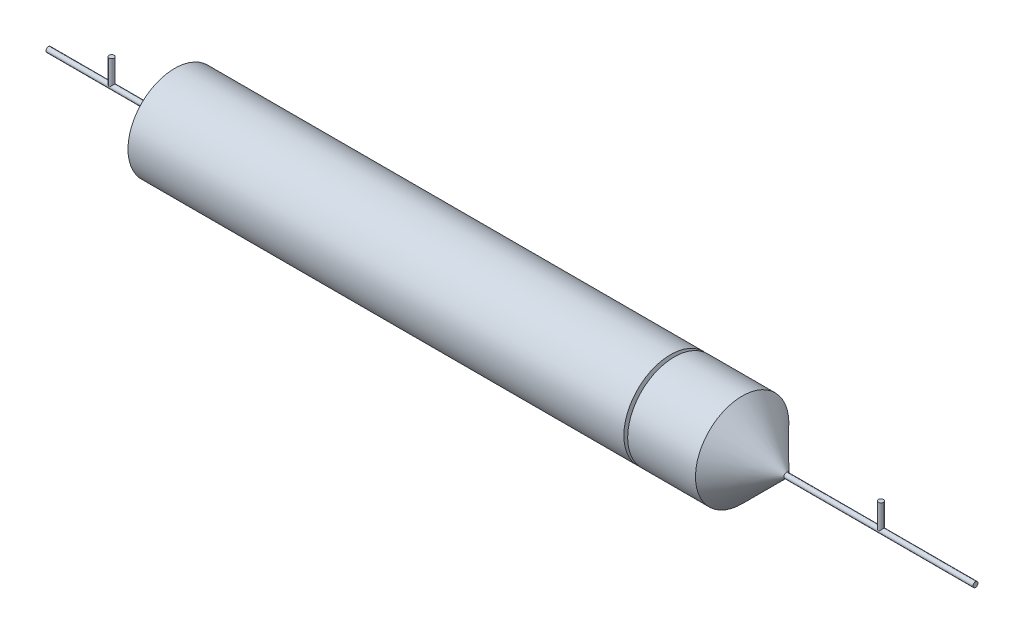
ISO-10303-21;
HEADER;
FILE_DESCRIPTION(('STEP AP214'),'2;1');
FILE_NAME('part.step','',(''),(''),'','','');
FILE_SCHEMA(('AUTOMOTIVE_DESIGN { 1 0 10303 214 1 1 1 1 }'));
ENDSEC;
DATA;
#1=APPLICATION_CONTEXT('core data for automotive mechanical design processes');
#2=APPLICATION_PROTOCOL_DEFINITION('international standard','automotive_design',2000,#1);
#3=PRODUCT_CONTEXT('',#1,'mechanical');
#4=PRODUCT('Part','Part','',(#3));
#5=PRODUCT_RELATED_PRODUCT_CATEGORY('part','',(#4));
#6=PRODUCT_DEFINITION_FORMATION('','',#4);
#7=PRODUCT_DEFINITION_CONTEXT('part definition',#1,'design');
#8=PRODUCT_DEFINITION('design','',#6,#7);
#9=PRODUCT_DEFINITION_SHAPE('','',#8);
#10=(LENGTH_UNIT() NAMED_UNIT(*) SI_UNIT(.MILLI.,.METRE.));
#11=(NAMED_UNIT(*) PLANE_ANGLE_UNIT() SI_UNIT($,.RADIAN.));
#12=(NAMED_UNIT(*) SI_UNIT($,.STERADIAN.) SOLID_ANGLE_UNIT());
#13=UNCERTAINTY_MEASURE_WITH_UNIT(LENGTH_MEASURE(1.E-05),#10,'distance_accuracy_value','');
#14=(GEOMETRIC_REPRESENTATION_CONTEXT(3) GLOBAL_UNCERTAINTY_ASSIGNED_CONTEXT((#13)) GLOBAL_UNIT_ASSIGNED_CONTEXT((#10,
#11,#12)) REPRESENTATION_CONTEXT('',''));
#15=CARTESIAN_POINT('',(0.,0.,0.));
#16=DIRECTION('',(0.,0.,1.));
#17=DIRECTION('',(1.,0.,0.));
#18=AXIS2_PLACEMENT_3D('',#15,#16,#17);
#19=CARTESIAN_POINT('',(-125.,0.,0.));
#20=DIRECTION('',(-1.,0.,0.));
#21=DIRECTION('',(0.,-1.,0.));
#22=AXIS2_PLACEMENT_3D('',#19,#20,#21);
#23=CYLINDRICAL_SURFACE('',#22,37.);
#24=CARTESIAN_POINT('',(225.,0.,0.));
#25=DIRECTION('',(-1.,0.,0.));
#26=DIRECTION('',(0.,-1.,0.));
#27=AXIS2_PLACEMENT_3D('',#24,#25,#26);
#28=CIRCLE('',#27,37.);
#29=CARTESIAN_POINT('',(225.,-37.,0.));
#30=VERTEX_POINT('',#29);
#31=EDGE_CURVE('E95',#30,#30,#28,.T.);
#32=ORIENTED_EDGE('',*,*,#31,.T.);
#33=EDGE_LOOP('',(#32));
#34=FACE_BOUND('',#33,.T.);
#35=CARTESIAN_POINT('',(171.204710686802,0.,0.));
#36=DIRECTION('',(-1.,0.,0.));
#37=DIRECTION('',(0.,0.,1.));
#38=AXIS2_PLACEMENT_3D('',#35,#36,#37);
#39=CIRCLE('',#38,37.);
#40=CARTESIAN_POINT('',(171.204710686802,0.,36.9999999999999));
#41=VERTEX_POINT('',#40);
#42=EDGE_CURVE('E119',#41,#41,#39,.T.);
#43=ORIENTED_EDGE('',*,*,#42,.F.);
#44=EDGE_LOOP('',(#43));
#45=FACE_BOUND('',#44,.T.);
#46=ADVANCED_FACE('F48',(#34,#45),#23,.T.);
#47=CARTESIAN_POINT('',(-125.,0.,0.));
#48=DIRECTION('',(-1.,0.,0.));
#49=DIRECTION('',(0.,-1.,0.));
#50=AXIS2_PLACEMENT_3D('',#47,#48,#49);
#51=CYLINDRICAL_SURFACE('',#50,2.);
#52=CARTESIAN_POINT('',(410.,0.,0.));
#53=DIRECTION('',(-1.,0.,0.));
#54=DIRECTION('',(0.,-1.,0.));
#55=AXIS2_PLACEMENT_3D('',#52,#53,#54);
#56=CIRCLE('',#55,2.00000000000001);
#57=CARTESIAN_POINT('',(410.,-2.00000000000001,0.));
#58=VERTEX_POINT('',#57);
#59=EDGE_CURVE('E103',#58,#58,#56,.T.);
#60=ORIENTED_EDGE('',*,*,#59,.T.);
#61=EDGE_LOOP('',(#60));
#62=FACE_BOUND('',#61,.T.);
#63=CARTESIAN_POINT('',(260.,0.,0.));
#64=DIRECTION('',(-1.,0.,0.));
#65=DIRECTION('',(0.,-1.,0.));
#66=AXIS2_PLACEMENT_3D('',#63,#64,#65);
#67=CIRCLE('',#66,2.);
#68=CARTESIAN_POINT('',(260.,-2.,0.));
#69=VERTEX_POINT('',#68);
#70=EDGE_CURVE('E99',#69,#69,#67,.T.);
#71=ORIENTED_EDGE('',*,*,#70,.F.);
#72=EDGE_LOOP('',(#71));
#73=FACE_BOUND('',#72,.T.);
#74=CARTESIAN_POINT('',(335.,0.,0.));
#75=DIRECTION('',(-0.707106781186547,-0.707106781186547,0.));
#76=DIRECTION('',(-0.707106781186547,0.707106781186547,0.));
#77=AXIS2_PLACEMENT_3D('',#74,#75,#76);
#78=ELLIPSE('',#77,2.82842712474619,2.);
#79=CARTESIAN_POINT('',(335.,0.,-2.));
#80=VERTEX_POINT('',#79);
#81=CARTESIAN_POINT('',(335.,0.,2.));
#82=VERTEX_POINT('',#81);
#83=EDGE_CURVE('E11',#80,#82,#78,.F.);
#84=ORIENTED_EDGE('',*,*,#83,.F.);
#85=CARTESIAN_POINT('',(335.,0.,0.));
#86=DIRECTION('',(-0.707106781186547,0.707106781186547,0.));
#87=DIRECTION('',(-0.707106781186547,-0.707106781186547,0.));
#88=AXIS2_PLACEMENT_3D('',#85,#86,#87);
#89=ELLIPSE('',#88,2.82842712474619,2.);
#90=EDGE_CURVE('E57',#82,#80,#89,.T.);
#91=ORIENTED_EDGE('',*,*,#90,.F.);
#92=EDGE_LOOP('',(#84,#91));
#93=FACE_BOUND('',#92,.T.);
#94=ADVANCED_FACE('F73',(#62,#73,#93),#51,.T.);
#95=CARTESIAN_POINT('',(410.,2.,0.));
#96=DIRECTION('',(-1.,0.,0.));
#97=DIRECTION('',(0.,-1.,0.));
#98=AXIS2_PLACEMENT_3D('',#95,#96,#97);
#99=PLANE('',#98);
#100=ORIENTED_EDGE('',*,*,#59,.F.);
#101=EDGE_LOOP('',(#100));
#102=FACE_BOUND('',#101,.T.);
#103=ADVANCED_FACE('F50',(#102),#99,.F.);
#104=CARTESIAN_POINT('',(260.,0.,0.));
#105=DIRECTION('',(-1.,0.,0.));
#106=DIRECTION('',(0.,-1.,0.));
#107=AXIS2_PLACEMENT_3D('',#104,#105,#106);
#108=CONICAL_SURFACE('',#107,2.,0.785398163397452);
#109=ORIENTED_EDGE('',*,*,#31,.F.);
#110=EDGE_LOOP('',(#109));
#111=FACE_BOUND('',#110,.T.);
#112=ORIENTED_EDGE('',*,*,#70,.T.);
#113=EDGE_LOOP('',(#112));
#114=FACE_BOUND('',#113,.T.);
#115=ADVANCED_FACE('F217',(#111,#114),#108,.T.);
#116=CARTESIAN_POINT('',(335.,20.,0.));
#117=DIRECTION('',(0.,-1.,0.));
#118=DIRECTION('',(0.,0.,-1.));
#119=AXIS2_PLACEMENT_3D('',#116,#117,#118);
#120=CYLINDRICAL_SURFACE('',#119,2.);
#121=CARTESIAN_POINT('',(335.,20.,0.));
#122=DIRECTION('',(0.,1.,0.));
#123=DIRECTION('',(0.,0.,1.));
#124=AXIS2_PLACEMENT_3D('',#121,#122,#123);
#125=CIRCLE('',#124,2.);
#126=CARTESIAN_POINT('',(335.,20.,2.));
#127=VERTEX_POINT('',#126);
#128=EDGE_CURVE('E111',#127,#127,#125,.T.);
#129=ORIENTED_EDGE('',*,*,#128,.F.);
#130=EDGE_LOOP('',(#129));
#131=FACE_BOUND('',#130,.T.);
#132=ORIENTED_EDGE('',*,*,#90,.T.);
#133=ORIENTED_EDGE('',*,*,#83,.T.);
#134=EDGE_LOOP('',(#132,#133));
#135=FACE_BOUND('',#134,.T.);
#136=ADVANCED_FACE('F75',(#131,#135),#120,.T.);
#137=CARTESIAN_POINT('',(335.,20.,0.));
#138=DIRECTION('',(0.,1.,0.));
#139=DIRECTION('',(0.,0.,1.));
#140=AXIS2_PLACEMENT_3D('',#137,#138,#139);
#141=PLANE('',#140);
#142=ORIENTED_EDGE('',*,*,#128,.T.);
#143=EDGE_LOOP('',(#142));
#144=FACE_BOUND('',#143,.T.);
#145=ADVANCED_FACE('F154',(#144),#141,.T.);
#146=CARTESIAN_POINT('',(181.031907011989,0.,0.));
#147=DIRECTION('',(-1.,0.,0.));
#148=DIRECTION('',(0.,0.,1.));
#149=AXIS2_PLACEMENT_3D('',#146,#147,#148);
#150=PLANE('',#149);
#151=CARTESIAN_POINT('',(181.031907011989,0.,0.));
#152=DIRECTION('',(-1.,0.,0.));
#153=DIRECTION('',(0.,0.,1.));
#154=AXIS2_PLACEMENT_3D('',#151,#152,#153);
#155=CIRCLE('',#154,0.5);
#156=CARTESIAN_POINT('',(181.031907011989,0.,0.5));
#157=VERTEX_POINT('',#156);
#158=EDGE_CURVE('E131',#157,#157,#155,.T.);
#159=ORIENTED_EDGE('',*,*,#158,.F.);
#160=EDGE_LOOP('',(#159));
#161=FACE_BOUND('',#160,.T.);
#162=CARTESIAN_POINT('',(181.031907011989,0.,0.));
#163=DIRECTION('',(-1.,0.,0.));
#164=DIRECTION('',(0.,0.,1.));
#165=AXIS2_PLACEMENT_3D('',#162,#163,#164);
#166=CIRCLE('',#165,10.);
#167=CARTESIAN_POINT('',(181.031907011989,0.,9.99999999999998));
#168=VERTEX_POINT('',#167);
#169=EDGE_CURVE('E115',#168,#168,#166,.T.);
#170=ORIENTED_EDGE('',*,*,#169,.T.);
#171=EDGE_LOOP('',(#170));
#172=FACE_BOUND('',#171,.T.);
#173=ADVANCED_FACE('F150',(#161,#172),#150,.T.);
#174=CARTESIAN_POINT('',(181.031907011989,0.,0.));
#175=DIRECTION('',(-1.,0.,0.));
#176=DIRECTION('',(0.,0.,1.));
#177=AXIS2_PLACEMENT_3D('',#174,#175,#176);
#178=CONICAL_SURFACE('',#177,10.,1.22173047639603);
#179=ORIENTED_EDGE('',*,*,#42,.T.);
#180=EDGE_LOOP('',(#179));
#181=FACE_BOUND('',#180,.T.);
#182=ORIENTED_EDGE('',*,*,#169,.F.);
#183=EDGE_LOOP('',(#182));
#184=FACE_BOUND('',#183,.T.);
#185=ADVANCED_FACE('F153',(#181,#184),#178,.F.);
#186=CARTESIAN_POINT('',(168.204710686802,0.,0.));
#187=DIRECTION('',(-1.,0.,0.));
#188=DIRECTION('',(0.,0.,1.));
#189=AXIS2_PLACEMENT_3D('',#186,#187,#188);
#190=CONICAL_SURFACE('',#189,37.,1.22173047639603);
#191=CARTESIAN_POINT('',(178.031907011989,0.,0.));
#192=DIRECTION('',(-1.,0.,0.));
#193=DIRECTION('',(0.,0.,1.));
#194=AXIS2_PLACEMENT_3D('',#191,#192,#193);
#195=CIRCLE('',#194,10.);
#196=CARTESIAN_POINT('',(178.031907011989,0.,9.99999999999998));
#197=VERTEX_POINT('',#196);
#198=EDGE_CURVE('E127',#197,#197,#195,.T.);
#199=ORIENTED_EDGE('',*,*,#198,.T.);
#200=EDGE_LOOP('',(#199));
#201=FACE_BOUND('',#200,.T.);
#202=CARTESIAN_POINT('',(168.204710686802,0.,0.));
#203=DIRECTION('',(-1.,0.,0.));
#204=DIRECTION('',(0.,0.,1.));
#205=AXIS2_PLACEMENT_3D('',#202,#203,#204);
#206=CIRCLE('',#205,37.);
#207=CARTESIAN_POINT('',(168.204710686802,0.,36.9999999999999));
#208=VERTEX_POINT('',#207);
#209=EDGE_CURVE('E123',#208,#208,#206,.T.);
#210=ORIENTED_EDGE('',*,*,#209,.F.);
#211=EDGE_LOOP('',(#210));
#212=FACE_BOUND('',#211,.T.);
#213=ADVANCED_FACE('F159',(#201,#212),#190,.T.);
#214=CARTESIAN_POINT('',(178.031907011989,0.,0.));
#215=DIRECTION('',(1.,0.,0.));
#216=DIRECTION('',(0.,0.,-1.));
#217=AXIS2_PLACEMENT_3D('',#214,#215,#216);
#218=PLANE('',#217);
#219=CARTESIAN_POINT('',(178.031907011989,0.,0.));
#220=DIRECTION('',(-1.,0.,0.));
#221=DIRECTION('',(0.,0.,1.));
#222=AXIS2_PLACEMENT_3D('',#219,#220,#221);
#223=CIRCLE('',#222,0.5);
#224=CARTESIAN_POINT('',(178.031907011989,0.,0.5));
#225=VERTEX_POINT('',#224);
#226=EDGE_CURVE('E135',#225,#225,#223,.T.);
#227=ORIENTED_EDGE('',*,*,#226,.T.);
#228=EDGE_LOOP('',(#227));
#229=FACE_BOUND('',#228,.T.);
#230=ORIENTED_EDGE('',*,*,#198,.F.);
#231=EDGE_LOOP('',(#230));
#232=FACE_BOUND('',#231,.T.);
#233=ADVANCED_FACE('F140',(#229,#232),#218,.T.);
#234=CARTESIAN_POINT('',(188.031907011989,0.,0.));
#235=DIRECTION('',(-1.,0.,0.));
#236=DIRECTION('',(0.,0.,1.));
#237=AXIS2_PLACEMENT_3D('',#234,#235,#236);
#238=CYLINDRICAL_SURFACE('',#237,0.5);
#239=ORIENTED_EDGE('',*,*,#226,.F.);
#240=EDGE_LOOP('',(#239));
#241=FACE_BOUND('',#240,.T.);
#242=ORIENTED_EDGE('',*,*,#158,.T.);
#243=EDGE_LOOP('',(#242));
#244=FACE_BOUND('',#243,.T.);
#245=ADVANCED_FACE('F143',(#241,#244),#238,.T.);
#246=CARTESIAN_POINT('',(-275.,20.,0.));
#247=DIRECTION('',(0.,1.,0.));
#248=DIRECTION('',(0.,0.,1.));
#249=AXIS2_PLACEMENT_3D('',#246,#247,#248);
#250=PLANE('',#249);
#251=CARTESIAN_POINT('',(-275.,20.,0.));
#252=DIRECTION('',(0.,1.,0.));
#253=DIRECTION('',(0.,0.,1.));
#254=AXIS2_PLACEMENT_3D('',#251,#252,#253);
#255=CIRCLE('',#254,1.99999999999999);
#256=CARTESIAN_POINT('',(-275.,20.,1.99999999999999));
#257=VERTEX_POINT('',#256);
#258=EDGE_CURVE('E107',#257,#257,#255,.T.);
#259=ORIENTED_EDGE('',*,*,#258,.T.);
#260=EDGE_LOOP('',(#259));
#261=FACE_BOUND('',#260,.T.);
#262=ADVANCED_FACE('F146',(#261),#250,.T.);
#263=CARTESIAN_POINT('',(-275.,20.,0.));
#264=DIRECTION('',(0.,-1.,0.));
#265=DIRECTION('',(0.,0.,-1.));
#266=AXIS2_PLACEMENT_3D('',#263,#264,#265);
#267=CYLINDRICAL_SURFACE('',#266,1.99999999999999);
#268=ORIENTED_EDGE('',*,*,#258,.F.);
#269=EDGE_LOOP('',(#268));
#270=FACE_BOUND('',#269,.T.);
#271=CARTESIAN_POINT('',(-275.,0.,0.));
#272=DIRECTION('',(-0.707106781186547,0.707106781186547,0.));
#273=DIRECTION('',(-0.707106781186547,-0.707106781186547,0.));
#274=AXIS2_PLACEMENT_3D('',#271,#272,#273);
#275=ELLIPSE('',#274,2.82842712474616,1.99999999999998);
#276=CARTESIAN_POINT('',(-275.,0.,1.99999999999997));
#277=VERTEX_POINT('',#276);
#278=CARTESIAN_POINT('',(-275.,0.,-1.99999999999997));
#279=VERTEX_POINT('',#278);
#280=EDGE_CURVE('E68',#277,#279,#275,.T.);
#281=ORIENTED_EDGE('',*,*,#280,.T.);
#282=CARTESIAN_POINT('',(-275.,0.,0.));
#283=DIRECTION('',(-0.707106781186547,-0.707106781186547,0.));
#284=DIRECTION('',(-0.707106781186547,0.707106781186547,0.));
#285=AXIS2_PLACEMENT_3D('',#282,#283,#284);
#286=ELLIPSE('',#285,2.82842712474616,1.99999999999998);
#287=EDGE_CURVE('E77',#279,#277,#286,.F.);
#288=ORIENTED_EDGE('',*,*,#287,.T.);
#289=EDGE_LOOP('',(#281,#288));
#290=FACE_BOUND('',#289,.T.);
#291=ADVANCED_FACE('F198',(#270,#290),#267,.T.);
#292=CARTESIAN_POINT('',(-325.,0.,0.));
#293=DIRECTION('',(1.,0.,0.));
#294=DIRECTION('',(0.,1.,0.));
#295=AXIS2_PLACEMENT_3D('',#292,#293,#294);
#296=PLANE('',#295);
#297=CARTESIAN_POINT('',(-325.,0.,0.));
#298=DIRECTION('',(-1.,0.,0.));
#299=DIRECTION('',(0.,-1.,0.));
#300=AXIS2_PLACEMENT_3D('',#297,#298,#299);
#301=CIRCLE('',#300,1.99999999999997);
#302=CARTESIAN_POINT('',(-325.,-1.99999999999995,0.));
#303=VERTEX_POINT('',#302);
#304=EDGE_CURVE('E83',#303,#303,#301,.T.);
#305=ORIENTED_EDGE('',*,*,#304,.T.);
#306=EDGE_LOOP('',(#305));
#307=FACE_BOUND('',#306,.T.);
#308=ADVANCED_FACE('F194',(#307),#296,.F.);
#309=CARTESIAN_POINT('',(-125.,0.,0.));
#310=DIRECTION('',(-1.,0.,0.));
#311=DIRECTION('',(0.,-1.,0.));
#312=AXIS2_PLACEMENT_3D('',#309,#310,#311);
#313=CYLINDRICAL_SURFACE('',#312,1.99999999999997);
#314=CARTESIAN_POINT('',(-225.,0.,0.));
#315=DIRECTION('',(-1.,0.,0.));
#316=DIRECTION('',(0.,-1.,0.));
#317=AXIS2_PLACEMENT_3D('',#314,#315,#316);
#318=CIRCLE('',#317,1.99999999999997);
#319=CARTESIAN_POINT('',(-225.,-1.99999999999996,0.));
#320=VERTEX_POINT('',#319);
#321=EDGE_CURVE('E87',#320,#320,#318,.T.);
#322=ORIENTED_EDGE('',*,*,#321,.T.);
#323=EDGE_LOOP('',(#322));
#324=FACE_BOUND('',#323,.T.);
#325=ORIENTED_EDGE('',*,*,#304,.F.);
#326=EDGE_LOOP('',(#325));
#327=FACE_BOUND('',#326,.T.);
#328=ORIENTED_EDGE('',*,*,#287,.F.);
#329=ORIENTED_EDGE('',*,*,#280,.F.);
#330=EDGE_LOOP('',(#328,#329));
#331=FACE_BOUND('',#330,.T.);
#332=ADVANCED_FACE('F182',(#324,#327,#331),#313,.T.);
#333=CARTESIAN_POINT('',(-225.,1.99999999999999,0.));
#334=DIRECTION('',(1.,0.,0.));
#335=DIRECTION('',(0.,1.,0.));
#336=AXIS2_PLACEMENT_3D('',#333,#334,#335);
#337=PLANE('',#336);
#338=ORIENTED_EDGE('',*,*,#321,.F.);
#339=EDGE_LOOP('',(#338));
#340=FACE_BOUND('',#339,.T.);
#341=CARTESIAN_POINT('',(-225.,0.,0.));
#342=DIRECTION('',(-1.,0.,0.));
#343=DIRECTION('',(0.,-1.,0.));
#344=AXIS2_PLACEMENT_3D('',#341,#342,#343);
#345=CIRCLE('',#344,37.);
#346=CARTESIAN_POINT('',(-225.,-37.,0.));
#347=VERTEX_POINT('',#346);
#348=EDGE_CURVE('E91',#347,#347,#345,.T.);
#349=ORIENTED_EDGE('',*,*,#348,.T.);
#350=EDGE_LOOP('',(#349));
#351=FACE_BOUND('',#350,.T.);
#352=ADVANCED_FACE('F178',(#340,#351),#337,.F.);
#353=ORIENTED_EDGE('',*,*,#348,.F.);
#354=EDGE_LOOP('',(#353));
#355=FACE_BOUND('',#354,.T.);
#356=ORIENTED_EDGE('',*,*,#209,.T.);
#357=EDGE_LOOP('',(#356));
#358=FACE_BOUND('',#357,.T.);
#359=ADVANCED_FACE('F169',(#355,#358),#23,.T.);
#360=CLOSED_SHELL('',(#46,#94,#103,#115,#136,#145,#173,#185,#213,#233,#245,#262,#291,#308,#332,
#352,#359));
#361=MANIFOLD_SOLID_BREP('B2',#360);
#362=ADVANCED_BREP_SHAPE_REPRESENTATION('',(#18,#361),#14);
#363=SHAPE_DEFINITION_REPRESENTATION(#9,#362);
ENDSEC;
END-ISO-10303-21;
